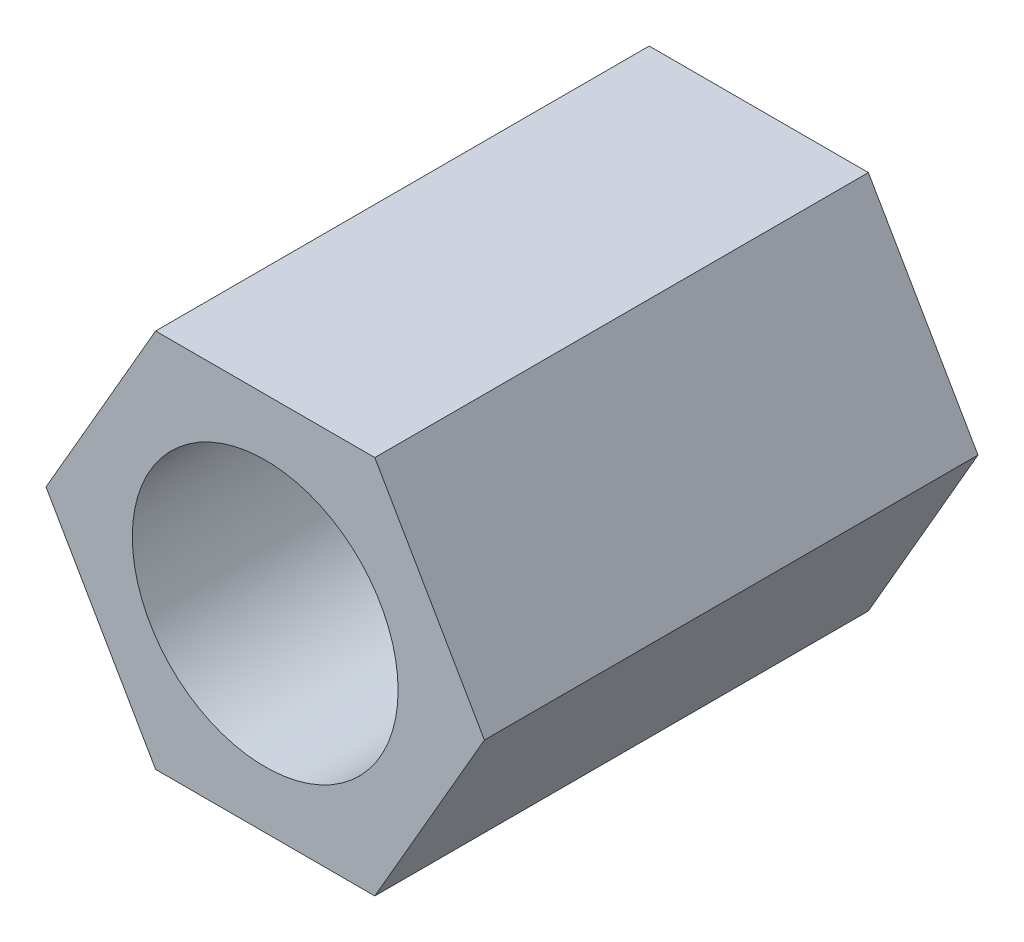
ISO-10303-21;
HEADER;
FILE_DESCRIPTION(('STEP AP214'),'2;1');
FILE_NAME('part.step','',(''),(''),'','','');
FILE_SCHEMA(('AUTOMOTIVE_DESIGN { 1 0 10303 214 1 1 1 1 }'));
ENDSEC;
DATA;
#1=APPLICATION_CONTEXT('core data for automotive mechanical design processes');
#2=APPLICATION_PROTOCOL_DEFINITION('international standard','automotive_design',2000,#1);
#3=PRODUCT_CONTEXT('',#1,'mechanical');
#4=PRODUCT('Part','Part','',(#3));
#5=PRODUCT_RELATED_PRODUCT_CATEGORY('part','',(#4));
#6=PRODUCT_DEFINITION_FORMATION('','',#4);
#7=PRODUCT_DEFINITION_CONTEXT('part definition',#1,'design');
#8=PRODUCT_DEFINITION('design','',#6,#7);
#9=PRODUCT_DEFINITION_SHAPE('','',#8);
#10=(LENGTH_UNIT() NAMED_UNIT(*) SI_UNIT(.MILLI.,.METRE.));
#11=(NAMED_UNIT(*) PLANE_ANGLE_UNIT() SI_UNIT($,.RADIAN.));
#12=(NAMED_UNIT(*) SI_UNIT($,.STERADIAN.) SOLID_ANGLE_UNIT());
#13=UNCERTAINTY_MEASURE_WITH_UNIT(LENGTH_MEASURE(1.E-05),#10,'distance_accuracy_value','');
#14=(GEOMETRIC_REPRESENTATION_CONTEXT(3) GLOBAL_UNCERTAINTY_ASSIGNED_CONTEXT((#13)) GLOBAL_UNIT_ASSIGNED_CONTEXT((#10,
#11,#12)) REPRESENTATION_CONTEXT('',''));
#15=CARTESIAN_POINT('',(0.,0.,0.));
#16=DIRECTION('',(0.,0.,1.));
#17=DIRECTION('',(1.,0.,0.));
#18=AXIS2_PLACEMENT_3D('',#15,#16,#17);
#19=CARTESIAN_POINT('',(2.88675134594813,0.,6.5));
#20=DIRECTION('',(-0.866025403784439,-0.5,0.));
#21=DIRECTION('',(0.5,-0.866025403784439,0.));
#22=AXIS2_PLACEMENT_3D('',#19,#20,#21);
#23=PLANE('',#22);
#24=DIRECTION('',(-0.5,0.866025403784439,0.));
#25=VECTOR('',#24,1.);
#26=CARTESIAN_POINT('',(2.88675134594813,0.,0.));
#27=LINE('',#26,#25);
#28=CARTESIAN_POINT('',(2.88675134594813,0.,0.));
#29=VERTEX_POINT('',#28);
#30=CARTESIAN_POINT('',(1.44337567297407,2.5,0.));
#31=VERTEX_POINT('',#30);
#32=EDGE_CURVE('E117',#29,#31,#27,.T.);
#33=ORIENTED_EDGE('',*,*,#32,.T.);
#34=DIRECTION('',(0.,0.,-1.));
#35=VECTOR('',#34,1.);
#36=CARTESIAN_POINT('',(1.44337567297407,2.5,6.5));
#37=LINE('',#36,#35);
#38=CARTESIAN_POINT('',(1.44337567297407,2.5,6.5));
#39=VERTEX_POINT('',#38);
#40=EDGE_CURVE('E11',#39,#31,#37,.T.);
#41=ORIENTED_EDGE('',*,*,#40,.F.);
#42=DIRECTION('',(-0.5,0.866025403784439,0.));
#43=VECTOR('',#42,1.);
#44=CARTESIAN_POINT('',(2.88675134594813,0.,6.5));
#45=LINE('',#44,#43);
#46=CARTESIAN_POINT('',(2.88675134594813,0.,6.5));
#47=VERTEX_POINT('',#46);
#48=EDGE_CURVE('E127',#47,#39,#45,.T.);
#49=ORIENTED_EDGE('',*,*,#48,.F.);
#50=DIRECTION('',(0.,0.,-1.));
#51=VECTOR('',#50,1.);
#52=CARTESIAN_POINT('',(2.88675134594813,0.,6.5));
#53=LINE('',#52,#51);
#54=EDGE_CURVE('E113',#47,#29,#53,.T.);
#55=ORIENTED_EDGE('',*,*,#54,.T.);
#56=EDGE_LOOP('',(#33,#41,#49,#55));
#57=FACE_BOUND('',#56,.T.);
#58=ADVANCED_FACE('F32',(#57),#23,.F.);
#59=CARTESIAN_POINT('',(1.44337567297407,2.5,6.5));
#60=DIRECTION('',(0.,-1.,0.));
#61=DIRECTION('',(1.,0.,0.));
#62=AXIS2_PLACEMENT_3D('',#59,#60,#61);
#63=PLANE('',#62);
#64=DIRECTION('',(-1.,0.,0.));
#65=VECTOR('',#64,1.);
#66=CARTESIAN_POINT('',(1.44337567297407,2.5,0.));
#67=LINE('',#66,#65);
#68=CARTESIAN_POINT('',(-1.44337567297406,2.5,0.));
#69=VERTEX_POINT('',#68);
#70=EDGE_CURVE('E120',#31,#69,#67,.T.);
#71=ORIENTED_EDGE('',*,*,#70,.T.);
#72=DIRECTION('',(0.,0.,-1.));
#73=VECTOR('',#72,1.);
#74=CARTESIAN_POINT('',(-1.44337567297406,2.5,6.5));
#75=LINE('',#74,#73);
#76=CARTESIAN_POINT('',(-1.44337567297406,2.5,6.5));
#77=VERTEX_POINT('',#76);
#78=EDGE_CURVE('E41',#77,#69,#75,.T.);
#79=ORIENTED_EDGE('',*,*,#78,.F.);
#80=DIRECTION('',(-1.,0.,0.));
#81=VECTOR('',#80,1.);
#82=CARTESIAN_POINT('',(1.44337567297407,2.5,6.5));
#83=LINE('',#82,#81);
#84=EDGE_CURVE('E86',#39,#77,#83,.T.);
#85=ORIENTED_EDGE('',*,*,#84,.F.);
#86=ORIENTED_EDGE('',*,*,#40,.T.);
#87=EDGE_LOOP('',(#71,#79,#85,#86));
#88=FACE_BOUND('',#87,.T.);
#89=ADVANCED_FACE('F153',(#88),#63,.F.);
#90=CARTESIAN_POINT('',(-1.44337567297406,2.5,6.5));
#91=DIRECTION('',(0.866025403784438,-0.5,0.));
#92=DIRECTION('',(0.5,0.866025403784439,0.));
#93=AXIS2_PLACEMENT_3D('',#90,#91,#92);
#94=PLANE('',#93);
#95=DIRECTION('',(-0.5,-0.866025403784439,0.));
#96=VECTOR('',#95,1.);
#97=CARTESIAN_POINT('',(-1.44337567297406,2.5,0.));
#98=LINE('',#97,#96);
#99=CARTESIAN_POINT('',(-2.88675134594813,0.,0.));
#100=VERTEX_POINT('',#99);
#101=EDGE_CURVE('E122',#69,#100,#98,.T.);
#102=ORIENTED_EDGE('',*,*,#101,.T.);
#103=DIRECTION('',(0.,0.,-1.));
#104=VECTOR('',#103,1.);
#105=CARTESIAN_POINT('',(-2.88675134594813,0.,6.5));
#106=LINE('',#105,#104);
#107=CARTESIAN_POINT('',(-2.88675134594813,0.,6.5));
#108=VERTEX_POINT('',#107);
#109=EDGE_CURVE('E108',#108,#100,#106,.T.);
#110=ORIENTED_EDGE('',*,*,#109,.F.);
#111=DIRECTION('',(-0.5,-0.866025403784439,0.));
#112=VECTOR('',#111,1.);
#113=CARTESIAN_POINT('',(-1.44337567297406,2.5,6.5));
#114=LINE('',#113,#112);
#115=EDGE_CURVE('E99',#77,#108,#114,.T.);
#116=ORIENTED_EDGE('',*,*,#115,.F.);
#117=ORIENTED_EDGE('',*,*,#78,.T.);
#118=EDGE_LOOP('',(#102,#110,#116,#117));
#119=FACE_BOUND('',#118,.T.);
#120=ADVANCED_FACE('F134',(#119),#94,.F.);
#121=CARTESIAN_POINT('',(-2.88675134594813,0.,6.5));
#122=DIRECTION('',(0.866025403784439,0.5,0.));
#123=DIRECTION('',(-0.5,0.866025403784439,0.));
#124=AXIS2_PLACEMENT_3D('',#121,#122,#123);
#125=PLANE('',#124);
#126=DIRECTION('',(0.5,-0.866025403784439,0.));
#127=VECTOR('',#126,1.);
#128=CARTESIAN_POINT('',(-2.88675134594813,0.,0.));
#129=LINE('',#128,#127);
#130=CARTESIAN_POINT('',(-1.44337567297406,-2.5,0.));
#131=VERTEX_POINT('',#130);
#132=EDGE_CURVE('E107',#100,#131,#129,.T.);
#133=ORIENTED_EDGE('',*,*,#132,.T.);
#134=DIRECTION('',(0.,0.,-1.));
#135=VECTOR('',#134,1.);
#136=CARTESIAN_POINT('',(-1.44337567297406,-2.5,6.5));
#137=LINE('',#136,#135);
#138=CARTESIAN_POINT('',(-1.44337567297406,-2.5,6.5));
#139=VERTEX_POINT('',#138);
#140=EDGE_CURVE('E104',#139,#131,#137,.T.);
#141=ORIENTED_EDGE('',*,*,#140,.F.);
#142=DIRECTION('',(0.5,-0.866025403784439,0.));
#143=VECTOR('',#142,1.);
#144=CARTESIAN_POINT('',(-2.88675134594813,0.,6.5));
#145=LINE('',#144,#143);
#146=EDGE_CURVE('E93',#108,#139,#145,.T.);
#147=ORIENTED_EDGE('',*,*,#146,.F.);
#148=ORIENTED_EDGE('',*,*,#109,.T.);
#149=EDGE_LOOP('',(#133,#141,#147,#148));
#150=FACE_BOUND('',#149,.T.);
#151=ADVANCED_FACE('F105',(#150),#125,.F.);
#152=CARTESIAN_POINT('',(-1.44337567297406,-2.5,6.5));
#153=DIRECTION('',(0.,1.,0.));
#154=DIRECTION('',(0.,0.,1.));
#155=AXIS2_PLACEMENT_3D('',#152,#153,#154);
#156=PLANE('',#155);
#157=DIRECTION('',(1.,0.,0.));
#158=VECTOR('',#157,1.);
#159=CARTESIAN_POINT('',(-1.44337567297406,-2.5,0.));
#160=LINE('',#159,#158);
#161=CARTESIAN_POINT('',(1.44337567297407,-2.5,0.));
#162=VERTEX_POINT('',#161);
#163=EDGE_CURVE('E72',#131,#162,#160,.T.);
#164=ORIENTED_EDGE('',*,*,#163,.T.);
#165=DIRECTION('',(0.,0.,-1.));
#166=VECTOR('',#165,1.);
#167=CARTESIAN_POINT('',(1.44337567297407,-2.5,6.5));
#168=LINE('',#167,#166);
#169=CARTESIAN_POINT('',(1.44337567297407,-2.5,6.5));
#170=VERTEX_POINT('',#169);
#171=EDGE_CURVE('E109',#170,#162,#168,.T.);
#172=ORIENTED_EDGE('',*,*,#171,.F.);
#173=DIRECTION('',(1.,0.,0.));
#174=VECTOR('',#173,1.);
#175=CARTESIAN_POINT('',(-1.44337567297406,-2.5,6.5));
#176=LINE('',#175,#174);
#177=EDGE_CURVE('E97',#139,#170,#176,.T.);
#178=ORIENTED_EDGE('',*,*,#177,.F.);
#179=ORIENTED_EDGE('',*,*,#140,.T.);
#180=EDGE_LOOP('',(#164,#172,#178,#179));
#181=FACE_BOUND('',#180,.T.);
#182=ADVANCED_FACE('F111',(#181),#156,.F.);
#183=CARTESIAN_POINT('',(1.44337567297407,-2.5,6.5));
#184=DIRECTION('',(-0.866025403784438,0.5,0.));
#185=DIRECTION('',(-0.5,-0.866025403784439,0.));
#186=AXIS2_PLACEMENT_3D('',#183,#184,#185);
#187=PLANE('',#186);
#188=DIRECTION('',(0.5,0.866025403784439,0.));
#189=VECTOR('',#188,1.);
#190=CARTESIAN_POINT('',(1.44337567297407,-2.5,0.));
#191=LINE('',#190,#189);
#192=EDGE_CURVE('E78',#162,#29,#191,.T.);
#193=ORIENTED_EDGE('',*,*,#192,.T.);
#194=ORIENTED_EDGE('',*,*,#54,.F.);
#195=DIRECTION('',(0.5,0.866025403784439,0.));
#196=VECTOR('',#195,1.);
#197=CARTESIAN_POINT('',(1.44337567297407,-2.5,6.5));
#198=LINE('',#197,#196);
#199=EDGE_CURVE('E49',#170,#47,#198,.T.);
#200=ORIENTED_EDGE('',*,*,#199,.F.);
#201=ORIENTED_EDGE('',*,*,#171,.T.);
#202=EDGE_LOOP('',(#193,#194,#200,#201));
#203=FACE_BOUND('',#202,.T.);
#204=ADVANCED_FACE('F141',(#203),#187,.F.);
#205=CARTESIAN_POINT('',(0.,0.,6.5));
#206=DIRECTION('',(0.,0.,1.));
#207=DIRECTION('',(1.,0.,0.));
#208=AXIS2_PLACEMENT_3D('',#205,#206,#207);
#209=PLANE('',#208);
#210=CARTESIAN_POINT('',(0.,0.,6.5));
#211=DIRECTION('',(0.,0.,1.));
#212=DIRECTION('',(1.,0.,0.));
#213=AXIS2_PLACEMENT_3D('',#210,#211,#212);
#214=CIRCLE('',#213,1.75);
#215=CARTESIAN_POINT('',(1.75,0.,6.5));
#216=VERTEX_POINT('',#215);
#217=EDGE_CURVE('E206',#216,#216,#214,.T.);
#218=ORIENTED_EDGE('',*,*,#217,.F.);
#219=EDGE_LOOP('',(#218));
#220=FACE_BOUND('',#219,.T.);
#221=ORIENTED_EDGE('',*,*,#48,.T.);
#222=ORIENTED_EDGE('',*,*,#84,.T.);
#223=ORIENTED_EDGE('',*,*,#115,.T.);
#224=ORIENTED_EDGE('',*,*,#146,.T.);
#225=ORIENTED_EDGE('',*,*,#177,.T.);
#226=ORIENTED_EDGE('',*,*,#199,.T.);
#227=EDGE_LOOP('',(#221,#222,#223,#224,#225,#226));
#228=FACE_BOUND('',#227,.T.);
#229=ADVANCED_FACE('F95',(#220,#228),#209,.T.);
#230=CARTESIAN_POINT('',(0.,0.,0.));
#231=DIRECTION('',(0.,0.,1.));
#232=DIRECTION('',(1.,0.,0.));
#233=AXIS2_PLACEMENT_3D('',#230,#231,#232);
#234=PLANE('',#233);
#235=CARTESIAN_POINT('',(0.,0.,0.));
#236=DIRECTION('',(0.,0.,1.));
#237=DIRECTION('',(1.,0.,0.));
#238=AXIS2_PLACEMENT_3D('',#235,#236,#237);
#239=CIRCLE('',#238,1.75);
#240=CARTESIAN_POINT('',(1.75,0.,0.));
#241=VERTEX_POINT('',#240);
#242=EDGE_CURVE('E35',#241,#241,#239,.T.);
#243=ORIENTED_EDGE('',*,*,#242,.T.);
#244=EDGE_LOOP('',(#243));
#245=FACE_BOUND('',#244,.T.);
#246=ORIENTED_EDGE('',*,*,#32,.F.);
#247=ORIENTED_EDGE('',*,*,#192,.F.);
#248=ORIENTED_EDGE('',*,*,#163,.F.);
#249=ORIENTED_EDGE('',*,*,#132,.F.);
#250=ORIENTED_EDGE('',*,*,#101,.F.);
#251=ORIENTED_EDGE('',*,*,#70,.F.);
#252=EDGE_LOOP('',(#246,#247,#248,#249,#250,#251));
#253=FACE_BOUND('',#252,.T.);
#254=ADVANCED_FACE('F137',(#245,#253),#234,.F.);
#255=CARTESIAN_POINT('',(0.,0.,-8.5));
#256=DIRECTION('',(0.,0.,1.));
#257=DIRECTION('',(1.,0.,0.));
#258=AXIS2_PLACEMENT_3D('',#255,#256,#257);
#259=CYLINDRICAL_SURFACE('',#258,1.75);
#260=ORIENTED_EDGE('',*,*,#217,.T.);
#261=EDGE_LOOP('',(#260));
#262=FACE_BOUND('',#261,.T.);
#263=ORIENTED_EDGE('',*,*,#242,.F.);
#264=EDGE_LOOP('',(#263));
#265=FACE_BOUND('',#264,.T.);
#266=ADVANCED_FACE('F190',(#262,#265),#259,.F.);
#267=CLOSED_SHELL('',(#58,#89,#120,#151,#182,#204,#229,#254,#266));
#268=MANIFOLD_SOLID_BREP('B2',#267);
#269=ADVANCED_BREP_SHAPE_REPRESENTATION('',(#18,#268),#14);
#270=SHAPE_DEFINITION_REPRESENTATION(#9,#269);
ENDSEC;
END-ISO-10303-21;
